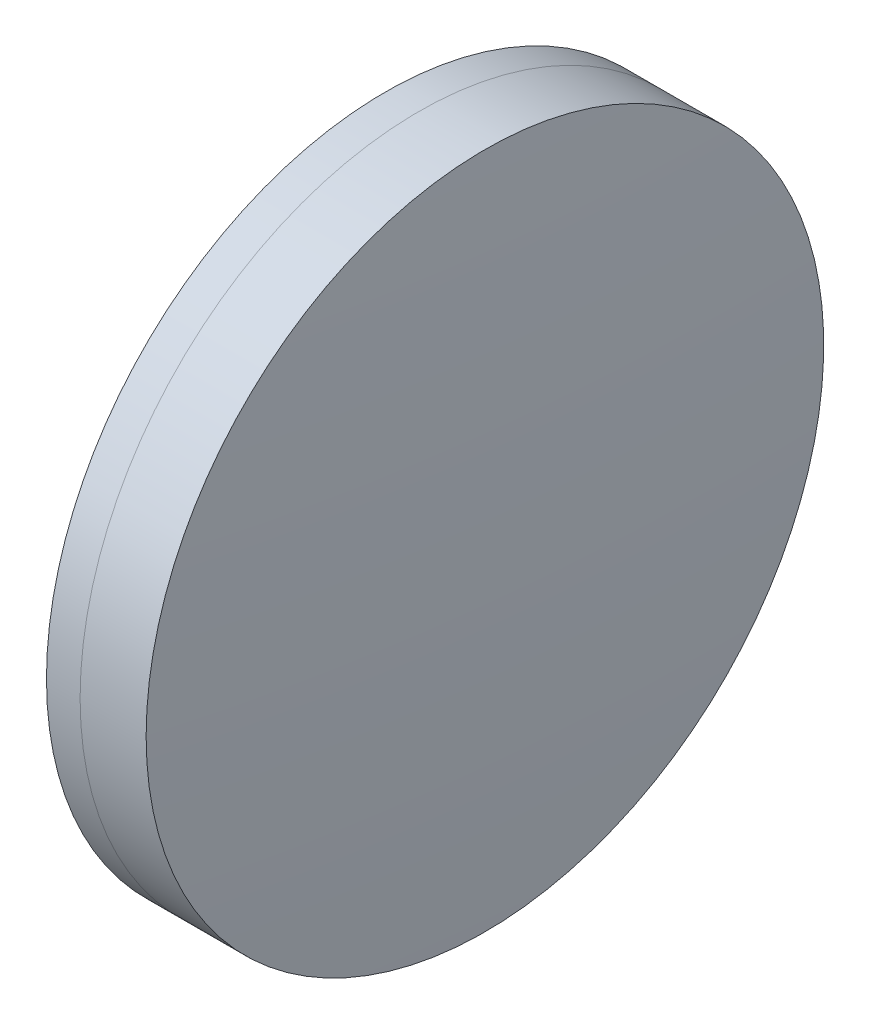
ISO-10303-21;
HEADER;
FILE_DESCRIPTION(('STEP AP214'),'2;1');
FILE_NAME('part.step','',(''),(''),'','','');
FILE_SCHEMA(('AUTOMOTIVE_DESIGN { 1 0 10303 214 1 1 1 1 }'));
ENDSEC;
DATA;
#1=APPLICATION_CONTEXT('core data for automotive mechanical design processes');
#2=APPLICATION_PROTOCOL_DEFINITION('international standard','automotive_design',2000,#1);
#3=PRODUCT_CONTEXT('',#1,'mechanical');
#4=PRODUCT('Part','Part','',(#3));
#5=PRODUCT_RELATED_PRODUCT_CATEGORY('part','',(#4));
#6=PRODUCT_DEFINITION_FORMATION('','',#4);
#7=PRODUCT_DEFINITION_CONTEXT('part definition',#1,'design');
#8=PRODUCT_DEFINITION('design','',#6,#7);
#9=PRODUCT_DEFINITION_SHAPE('','',#8);
#10=(LENGTH_UNIT() NAMED_UNIT(*) SI_UNIT(.MILLI.,.METRE.));
#11=(NAMED_UNIT(*) PLANE_ANGLE_UNIT() SI_UNIT($,.RADIAN.));
#12=(NAMED_UNIT(*) SI_UNIT($,.STERADIAN.) SOLID_ANGLE_UNIT());
#13=UNCERTAINTY_MEASURE_WITH_UNIT(LENGTH_MEASURE(1.E-05),#10,'distance_accuracy_value','');
#14=(GEOMETRIC_REPRESENTATION_CONTEXT(3) GLOBAL_UNCERTAINTY_ASSIGNED_CONTEXT((#13)) GLOBAL_UNIT_ASSIGNED_CONTEXT((#10,
#11,#12)) REPRESENTATION_CONTEXT('',''));
#15=CARTESIAN_POINT('',(0.,0.,0.));
#16=DIRECTION('',(0.,0.,1.));
#17=DIRECTION('',(1.,0.,0.));
#18=AXIS2_PLACEMENT_3D('',#15,#16,#17);
#19=CARTESIAN_POINT('',(180.903228187027,0.,0.));
#20=DIRECTION('',(-1.,0.,0.));
#21=DIRECTION('',(0.,0.,1.));
#22=AXIS2_PLACEMENT_3D('',#19,#20,#21);
#23=SPHERICAL_SURFACE('',#22,81.336);
#24=CARTESIAN_POINT('',(260.699734351144,0.,0.));
#25=DIRECTION('',(-1.,0.,0.));
#26=DIRECTION('',(0.,0.,1.));
#27=AXIS2_PLACEMENT_3D('',#24,#25,#26);
#28=CIRCLE('',#27,15.75);
#29=CARTESIAN_POINT('',(260.699734351144,0.,15.75));
#30=VERTEX_POINT('',#29);
#31=EDGE_CURVE('E11',#30,#30,#28,.T.);
#32=ORIENTED_EDGE('',*,*,#31,.T.);
#33=EDGE_LOOP('',(#32));
#34=FACE_BOUND('',#33,.T.);
#35=ADVANCED_FACE('F45',(#34),#23,.F.);
#36=CARTESIAN_POINT('',(-0.551919992657797,0.,0.));
#37=DIRECTION('',(-1.,0.,0.));
#38=DIRECTION('',(0.,0.,1.));
#39=AXIS2_PLACEMENT_3D('',#36,#37,#38);
#40=CYLINDRICAL_SURFACE('',#39,15.75);
#41=CARTESIAN_POINT('',(263.768972644587,0.,0.));
#42=DIRECTION('',(-1.,0.,0.));
#43=DIRECTION('',(0.,0.,1.));
#44=AXIS2_PLACEMENT_3D('',#41,#42,#43);
#45=CIRCLE('',#44,15.7499999999999);
#46=CARTESIAN_POINT('',(263.768972644587,0.,15.7499999999999));
#47=VERTEX_POINT('',#46);
#48=EDGE_CURVE('E51',#47,#47,#45,.T.);
#49=ORIENTED_EDGE('',*,*,#48,.T.);
#50=EDGE_LOOP('',(#49));
#51=FACE_BOUND('',#50,.T.);
#52=ORIENTED_EDGE('',*,*,#31,.F.);
#53=EDGE_LOOP('',(#52));
#54=FACE_BOUND('',#53,.T.);
#55=ADVANCED_FACE('F57',(#51,#54),#40,.T.);
#56=CARTESIAN_POINT('',(0.251228187026997,0.,0.));
#57=DIRECTION('',(-1.,0.,0.));
#58=DIRECTION('',(0.,0.,1.));
#59=AXIS2_PLACEMENT_3D('',#56,#57,#58);
#60=SPHERICAL_SURFACE('',#59,263.988);
#61=ORIENTED_EDGE('',*,*,#48,.F.);
#62=EDGE_LOOP('',(#61));
#63=FACE_BOUND('',#62,.T.);
#64=ADVANCED_FACE('F60',(#63),#60,.T.);
#65=CLOSED_SHELL('',(#35,#55,#64));
#66=MANIFOLD_SOLID_BREP('B2',#65);
#67=CARTESIAN_POINT('',(381.818228187027,0.,0.));
#68=DIRECTION('',(-1.,0.,0.));
#69=DIRECTION('',(0.,0.,-1.));
#70=AXIS2_PLACEMENT_3D('',#67,#68,#69);
#71=SPHERICAL_SURFACE('',#70,123.689);
#72=CARTESIAN_POINT('',(259.136093297712,0.,0.));
#73=DIRECTION('',(-1.,0.,0.));
#74=DIRECTION('',(0.,0.,1.));
#75=AXIS2_PLACEMENT_3D('',#72,#73,#74);
#76=CIRCLE('',#75,15.75);
#77=CARTESIAN_POINT('',(259.136093297712,0.,15.75));
#78=VERTEX_POINT('',#77);
#79=EDGE_CURVE('E44',#78,#78,#76,.T.);
#80=ORIENTED_EDGE('',*,*,#79,.T.);
#81=EDGE_LOOP('',(#80));
#82=FACE_BOUND('',#81,.T.);
#83=ADVANCED_FACE('F86',(#82),#71,.T.);
#84=CARTESIAN_POINT('',(124.523309526045,0.,0.));
#85=DIRECTION('',(-1.,0.,0.));
#86=DIRECTION('',(0.,0.,1.));
#87=AXIS2_PLACEMENT_3D('',#84,#85,#86);
#88=CYLINDRICAL_SURFACE('',#87,15.75);
#89=CARTESIAN_POINT('',(260.699734351144,0.,0.));
#90=DIRECTION('',(-1.,0.,0.));
#91=DIRECTION('',(0.,0.,1.));
#92=AXIS2_PLACEMENT_3D('',#89,#90,#91);
#93=CIRCLE('',#92,15.75);
#94=CARTESIAN_POINT('',(260.699734351144,0.,15.75));
#95=VERTEX_POINT('',#94);
#96=EDGE_CURVE('E92',#95,#95,#93,.T.);
#97=ORIENTED_EDGE('',*,*,#96,.T.);
#98=EDGE_LOOP('',(#97));
#99=FACE_BOUND('',#98,.T.);
#100=ORIENTED_EDGE('',*,*,#79,.F.);
#101=EDGE_LOOP('',(#100));
#102=FACE_BOUND('',#101,.T.);
#103=ADVANCED_FACE('F98',(#99,#102),#88,.T.);
#104=CARTESIAN_POINT('',(180.903228187027,0.,0.));
#105=DIRECTION('',(-1.,0.,0.));
#106=DIRECTION('',(0.,0.,1.));
#107=AXIS2_PLACEMENT_3D('',#104,#105,#106);
#108=SPHERICAL_SURFACE('',#107,81.336);
#109=ORIENTED_EDGE('',*,*,#96,.F.);
#110=EDGE_LOOP('',(#109));
#111=FACE_BOUND('',#110,.T.);
#112=ADVANCED_FACE('F101',(#111),#108,.T.);
#113=CLOSED_SHELL('',(#83,#103,#112));
#114=MANIFOLD_SOLID_BREP('B6',#113);
#115=ADVANCED_BREP_SHAPE_REPRESENTATION('',(#18,#66,#114),#14);
#116=SHAPE_DEFINITION_REPRESENTATION(#9,#115);
ENDSEC;
END-ISO-10303-21;
